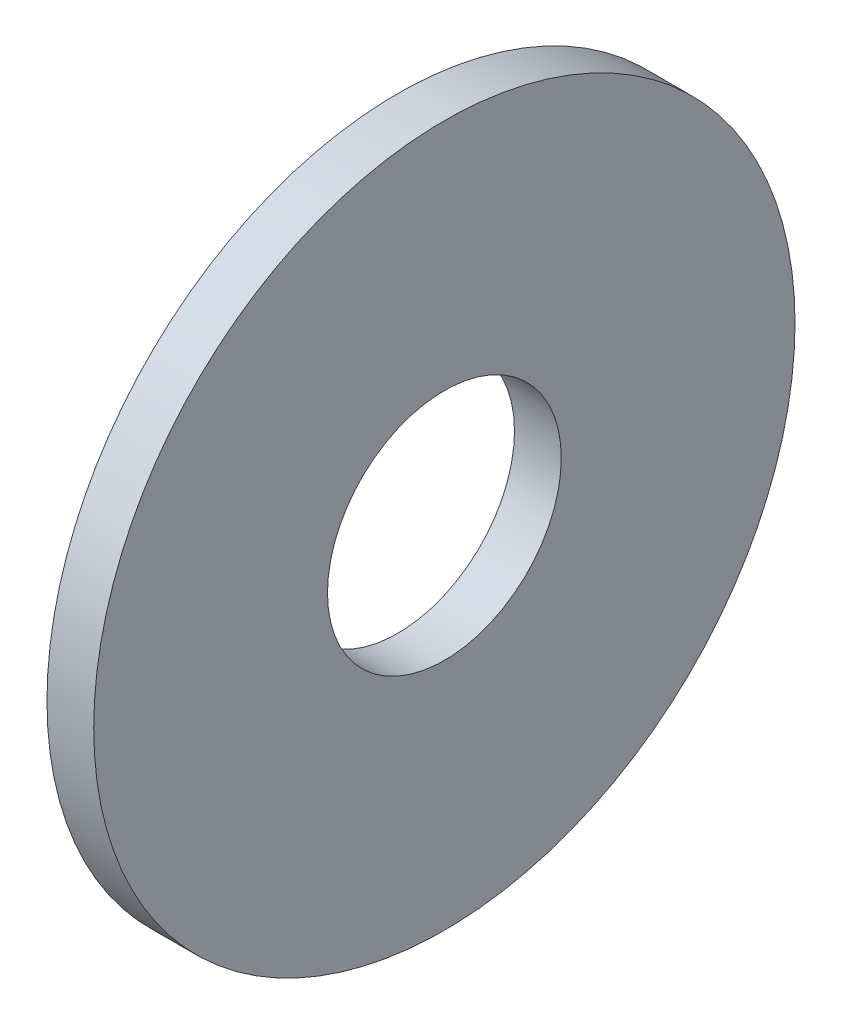
ISO-10303-21;
HEADER;
FILE_DESCRIPTION(('STEP AP214'),'2;1');
FILE_NAME('part.step','',(''),(''),'','','');
FILE_SCHEMA(('AUTOMOTIVE_DESIGN { 1 0 10303 214 1 1 1 1 }'));
ENDSEC;
DATA;
#1=APPLICATION_CONTEXT('core data for automotive mechanical design processes');
#2=APPLICATION_PROTOCOL_DEFINITION('international standard','automotive_design',2000,#1);
#3=PRODUCT_CONTEXT('',#1,'mechanical');
#4=PRODUCT('Part','Part','',(#3));
#5=PRODUCT_RELATED_PRODUCT_CATEGORY('part','',(#4));
#6=PRODUCT_DEFINITION_FORMATION('','',#4);
#7=PRODUCT_DEFINITION_CONTEXT('part definition',#1,'design');
#8=PRODUCT_DEFINITION('design','',#6,#7);
#9=PRODUCT_DEFINITION_SHAPE('','',#8);
#10=(LENGTH_UNIT() NAMED_UNIT(*) SI_UNIT(.MILLI.,.METRE.));
#11=(NAMED_UNIT(*) PLANE_ANGLE_UNIT() SI_UNIT($,.RADIAN.));
#12=(NAMED_UNIT(*) SI_UNIT($,.STERADIAN.) SOLID_ANGLE_UNIT());
#13=UNCERTAINTY_MEASURE_WITH_UNIT(LENGTH_MEASURE(1.E-05),#10,'distance_accuracy_value','');
#14=(GEOMETRIC_REPRESENTATION_CONTEXT(3) GLOBAL_UNCERTAINTY_ASSIGNED_CONTEXT((#13)) GLOBAL_UNIT_ASSIGNED_CONTEXT((#10,
#11,#12)) REPRESENTATION_CONTEXT('',''));
#15=CARTESIAN_POINT('',(0.,0.,0.));
#16=DIRECTION('',(0.,0.,1.));
#17=DIRECTION('',(1.,0.,0.));
#18=AXIS2_PLACEMENT_3D('',#15,#16,#17);
#19=CARTESIAN_POINT('',(1.,0.,0.));
#20=DIRECTION('',(1.,0.,0.));
#21=DIRECTION('',(0.,0.,-1.));
#22=AXIS2_PLACEMENT_3D('',#19,#20,#21);
#23=PLANE('',#22);
#24=CARTESIAN_POINT('',(1.,0.,0.));
#25=DIRECTION('',(1.,0.,0.));
#26=DIRECTION('',(0.,0.,-1.));
#27=AXIS2_PLACEMENT_3D('',#24,#25,#26);
#28=CIRCLE('',#27,7.5);
#29=CARTESIAN_POINT('',(1.,0.,-7.5));
#30=VERTEX_POINT('',#29);
#31=EDGE_CURVE('E10',#30,#30,#28,.T.);
#32=ORIENTED_EDGE('',*,*,#31,.T.);
#33=EDGE_LOOP('',(#32));
#34=FACE_BOUND('',#33,.T.);
#35=CARTESIAN_POINT('',(1.,0.,0.));
#36=DIRECTION('',(1.,0.,0.));
#37=DIRECTION('',(0.,0.,-1.));
#38=AXIS2_PLACEMENT_3D('',#35,#36,#37);
#39=CIRCLE('',#38,2.5);
#40=CARTESIAN_POINT('',(1.,0.,-2.5));
#41=VERTEX_POINT('',#40);
#42=EDGE_CURVE('E42',#41,#41,#39,.T.);
#43=ORIENTED_EDGE('',*,*,#42,.F.);
#44=EDGE_LOOP('',(#43));
#45=FACE_BOUND('',#44,.T.);
#46=ADVANCED_FACE('F31',(#34,#45),#23,.T.);
#47=CARTESIAN_POINT('',(0.,0.,0.));
#48=DIRECTION('',(1.,0.,0.));
#49=DIRECTION('',(0.,0.,-1.));
#50=AXIS2_PLACEMENT_3D('',#47,#48,#49);
#51=PLANE('',#50);
#52=CARTESIAN_POINT('',(0.,0.,0.));
#53=DIRECTION('',(1.,0.,0.));
#54=DIRECTION('',(0.,0.,-1.));
#55=AXIS2_PLACEMENT_3D('',#52,#53,#54);
#56=CIRCLE('',#55,7.5);
#57=CARTESIAN_POINT('',(0.,0.,-7.5));
#58=VERTEX_POINT('',#57);
#59=EDGE_CURVE('E35',#58,#58,#56,.T.);
#60=ORIENTED_EDGE('',*,*,#59,.F.);
#61=EDGE_LOOP('',(#60));
#62=FACE_BOUND('',#61,.T.);
#63=CARTESIAN_POINT('',(0.,0.,0.));
#64=DIRECTION('',(1.,0.,0.));
#65=DIRECTION('',(0.,0.,-1.));
#66=AXIS2_PLACEMENT_3D('',#63,#64,#65);
#67=CIRCLE('',#66,2.5);
#68=CARTESIAN_POINT('',(0.,0.,-2.5));
#69=VERTEX_POINT('',#68);
#70=EDGE_CURVE('E44',#69,#69,#67,.T.);
#71=ORIENTED_EDGE('',*,*,#70,.T.);
#72=EDGE_LOOP('',(#71));
#73=FACE_BOUND('',#72,.T.);
#74=ADVANCED_FACE('F54',(#62,#73),#51,.F.);
#75=CARTESIAN_POINT('',(1.,0.,0.));
#76=DIRECTION('',(-1.,0.,0.));
#77=DIRECTION('',(0.,0.,1.));
#78=AXIS2_PLACEMENT_3D('',#75,#76,#77);
#79=CYLINDRICAL_SURFACE('',#78,7.5);
#80=ORIENTED_EDGE('',*,*,#31,.F.);
#81=EDGE_LOOP('',(#80));
#82=FACE_BOUND('',#81,.T.);
#83=ORIENTED_EDGE('',*,*,#59,.T.);
#84=EDGE_LOOP('',(#83));
#85=FACE_BOUND('',#84,.T.);
#86=ADVANCED_FACE('F33',(#82,#85),#79,.T.);
#87=CARTESIAN_POINT('',(1.,0.,0.));
#88=DIRECTION('',(-1.,0.,0.));
#89=DIRECTION('',(0.,0.,1.));
#90=AXIS2_PLACEMENT_3D('',#87,#88,#89);
#91=CYLINDRICAL_SURFACE('',#90,2.5);
#92=ORIENTED_EDGE('',*,*,#42,.T.);
#93=EDGE_LOOP('',(#92));
#94=FACE_BOUND('',#93,.T.);
#95=ORIENTED_EDGE('',*,*,#70,.F.);
#96=EDGE_LOOP('',(#95));
#97=FACE_BOUND('',#96,.T.);
#98=ADVANCED_FACE('F50',(#94,#97),#91,.F.);
#99=CLOSED_SHELL('',(#46,#74,#86,#98));
#100=MANIFOLD_SOLID_BREP('B2',#99);
#101=ADVANCED_BREP_SHAPE_REPRESENTATION('',(#18,#100),#14);
#102=SHAPE_DEFINITION_REPRESENTATION(#9,#101);
ENDSEC;
END-ISO-10303-21;
